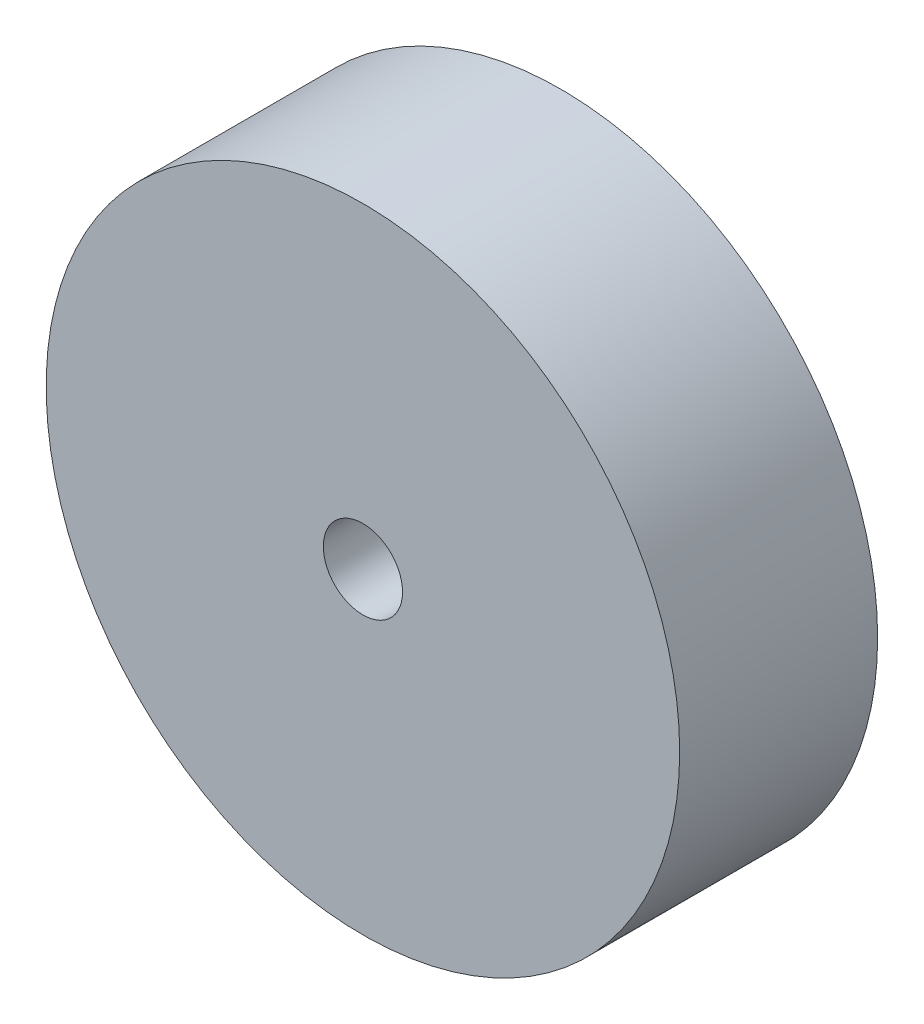
ISO-10303-21;
HEADER;
FILE_DESCRIPTION(('STEP AP214'),'2;1');
FILE_NAME('part.step','',(''),(''),'','','');
FILE_SCHEMA(('AUTOMOTIVE_DESIGN { 1 0 10303 214 1 1 1 1 }'));
ENDSEC;
DATA;
#1=APPLICATION_CONTEXT('core data for automotive mechanical design processes');
#2=APPLICATION_PROTOCOL_DEFINITION('international standard','automotive_design',2000,#1);
#3=PRODUCT_CONTEXT('',#1,'mechanical');
#4=PRODUCT('Part','Part','',(#3));
#5=PRODUCT_RELATED_PRODUCT_CATEGORY('part','',(#4));
#6=PRODUCT_DEFINITION_FORMATION('','',#4);
#7=PRODUCT_DEFINITION_CONTEXT('part definition',#1,'design');
#8=PRODUCT_DEFINITION('design','',#6,#7);
#9=PRODUCT_DEFINITION_SHAPE('','',#8);
#10=(LENGTH_UNIT() NAMED_UNIT(*) SI_UNIT(.MILLI.,.METRE.));
#11=(NAMED_UNIT(*) PLANE_ANGLE_UNIT() SI_UNIT($,.RADIAN.));
#12=(NAMED_UNIT(*) SI_UNIT($,.STERADIAN.) SOLID_ANGLE_UNIT());
#13=UNCERTAINTY_MEASURE_WITH_UNIT(LENGTH_MEASURE(1.E-05),#10,'distance_accuracy_value','');
#14=(GEOMETRIC_REPRESENTATION_CONTEXT(3) GLOBAL_UNCERTAINTY_ASSIGNED_CONTEXT((#13)) GLOBAL_UNIT_ASSIGNED_CONTEXT((#10,
#11,#12)) REPRESENTATION_CONTEXT('',''));
#15=CARTESIAN_POINT('',(0.,0.,0.));
#16=DIRECTION('',(0.,0.,1.));
#17=DIRECTION('',(1.,0.,0.));
#18=AXIS2_PLACEMENT_3D('',#15,#16,#17);
#19=CARTESIAN_POINT('',(0.,0.,12.5));
#20=DIRECTION('',(0.,0.,-1.));
#21=DIRECTION('',(-1.,0.,0.));
#22=AXIS2_PLACEMENT_3D('',#19,#20,#21);
#23=CYLINDRICAL_SURFACE('',#22,20.);
#24=CARTESIAN_POINT('',(0.,0.,12.5));
#25=DIRECTION('',(0.,0.,1.));
#26=DIRECTION('',(1.,0.,0.));
#27=AXIS2_PLACEMENT_3D('',#24,#25,#26);
#28=CIRCLE('',#27,20.);
#29=CARTESIAN_POINT('',(20.,0.,12.5));
#30=VERTEX_POINT('',#29);
#31=EDGE_CURVE('E10',#30,#30,#28,.T.);
#32=ORIENTED_EDGE('',*,*,#31,.F.);
#33=EDGE_LOOP('',(#32));
#34=FACE_BOUND('',#33,.T.);
#35=CARTESIAN_POINT('',(0.,0.,0.));
#36=DIRECTION('',(0.,0.,1.));
#37=DIRECTION('',(1.,0.,0.));
#38=AXIS2_PLACEMENT_3D('',#35,#36,#37);
#39=CIRCLE('',#38,20.);
#40=CARTESIAN_POINT('',(20.,0.,0.));
#41=VERTEX_POINT('',#40);
#42=EDGE_CURVE('E33',#41,#41,#39,.T.);
#43=ORIENTED_EDGE('',*,*,#42,.T.);
#44=EDGE_LOOP('',(#43));
#45=FACE_BOUND('',#44,.T.);
#46=ADVANCED_FACE('F30',(#34,#45),#23,.T.);
#47=CARTESIAN_POINT('',(0.,0.,12.5));
#48=DIRECTION('',(0.,0.,1.));
#49=DIRECTION('',(1.,0.,0.));
#50=AXIS2_PLACEMENT_3D('',#47,#48,#49);
#51=PLANE('',#50);
#52=CARTESIAN_POINT('',(0.,0.,12.5));
#53=DIRECTION('',(0.,0.,1.));
#54=DIRECTION('',(1.,0.,0.));
#55=AXIS2_PLACEMENT_3D('',#52,#53,#54);
#56=CIRCLE('',#55,2.5);
#57=CARTESIAN_POINT('',(2.5,0.,12.5));
#58=VERTEX_POINT('',#57);
#59=EDGE_CURVE('E42',#58,#58,#56,.T.);
#60=ORIENTED_EDGE('',*,*,#59,.F.);
#61=EDGE_LOOP('',(#60));
#62=FACE_BOUND('',#61,.T.);
#63=ORIENTED_EDGE('',*,*,#31,.T.);
#64=EDGE_LOOP('',(#63));
#65=FACE_BOUND('',#64,.T.);
#66=ADVANCED_FACE('F57',(#62,#65),#51,.T.);
#67=CARTESIAN_POINT('',(0.,0.,0.));
#68=DIRECTION('',(0.,0.,1.));
#69=DIRECTION('',(1.,0.,0.));
#70=AXIS2_PLACEMENT_3D('',#67,#68,#69);
#71=PLANE('',#70);
#72=CARTESIAN_POINT('',(0.,0.,0.));
#73=DIRECTION('',(0.,0.,1.));
#74=DIRECTION('',(1.,0.,0.));
#75=AXIS2_PLACEMENT_3D('',#72,#73,#74);
#76=CIRCLE('',#75,2.5);
#77=CARTESIAN_POINT('',(2.5,0.,0.));
#78=VERTEX_POINT('',#77);
#79=EDGE_CURVE('E40',#78,#78,#76,.T.);
#80=ORIENTED_EDGE('',*,*,#79,.T.);
#81=EDGE_LOOP('',(#80));
#82=FACE_BOUND('',#81,.T.);
#83=ORIENTED_EDGE('',*,*,#42,.F.);
#84=EDGE_LOOP('',(#83));
#85=FACE_BOUND('',#84,.T.);
#86=ADVANCED_FACE('F48',(#82,#85),#71,.F.);
#87=CARTESIAN_POINT('',(0.,0.,0.));
#88=DIRECTION('',(0.,0.,1.));
#89=DIRECTION('',(1.,0.,0.));
#90=AXIS2_PLACEMENT_3D('',#87,#88,#89);
#91=CYLINDRICAL_SURFACE('',#90,2.5);
#92=ORIENTED_EDGE('',*,*,#79,.F.);
#93=EDGE_LOOP('',(#92));
#94=FACE_BOUND('',#93,.T.);
#95=ORIENTED_EDGE('',*,*,#59,.T.);
#96=EDGE_LOOP('',(#95));
#97=FACE_BOUND('',#96,.T.);
#98=ADVANCED_FACE('F51',(#94,#97),#91,.F.);
#99=CLOSED_SHELL('',(#46,#66,#86,#98));
#100=MANIFOLD_SOLID_BREP('B2',#99);
#101=ADVANCED_BREP_SHAPE_REPRESENTATION('',(#18,#100),#14);
#102=SHAPE_DEFINITION_REPRESENTATION(#9,#101);
ENDSEC;
END-ISO-10303-21;
